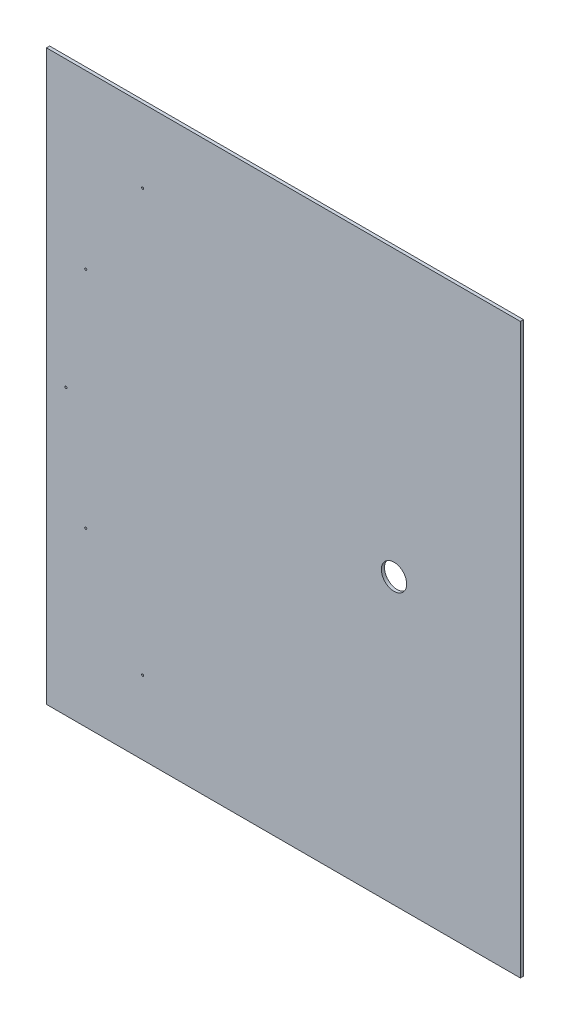
ISO-10303-21;
HEADER;
FILE_DESCRIPTION(('STEP AP214'),'2;1');
FILE_NAME('part.step','',(''),(''),'','','');
FILE_SCHEMA(('AUTOMOTIVE_DESIGN { 1 0 10303 214 1 1 1 1 }'));
ENDSEC;
DATA;
#1=APPLICATION_CONTEXT('core data for automotive mechanical design processes');
#2=APPLICATION_PROTOCOL_DEFINITION('international standard','automotive_design',2000,#1);
#3=PRODUCT_CONTEXT('',#1,'mechanical');
#4=PRODUCT('Part','Part','',(#3));
#5=PRODUCT_RELATED_PRODUCT_CATEGORY('part','',(#4));
#6=PRODUCT_DEFINITION_FORMATION('','',#4);
#7=PRODUCT_DEFINITION_CONTEXT('part definition',#1,'design');
#8=PRODUCT_DEFINITION('design','',#6,#7);
#9=PRODUCT_DEFINITION_SHAPE('','',#8);
#10=(LENGTH_UNIT() NAMED_UNIT(*) SI_UNIT(.MILLI.,.METRE.));
#11=(NAMED_UNIT(*) PLANE_ANGLE_UNIT() SI_UNIT($,.RADIAN.));
#12=(NAMED_UNIT(*) SI_UNIT($,.STERADIAN.) SOLID_ANGLE_UNIT());
#13=UNCERTAINTY_MEASURE_WITH_UNIT(LENGTH_MEASURE(1.E-05),#10,'distance_accuracy_value','');
#14=(GEOMETRIC_REPRESENTATION_CONTEXT(3) GLOBAL_UNCERTAINTY_ASSIGNED_CONTEXT((#13)) GLOBAL_UNIT_ASSIGNED_CONTEXT((#10,
#11,#12)) REPRESENTATION_CONTEXT('',''));
#15=CARTESIAN_POINT('',(0.,0.,0.));
#16=DIRECTION('',(0.,0.,1.));
#17=DIRECTION('',(1.,0.,0.));
#18=AXIS2_PLACEMENT_3D('',#15,#16,#17);
#19=CARTESIAN_POINT('',(-750.,-900.,10.));
#20=DIRECTION('',(-1.,0.,0.));
#21=DIRECTION('',(0.,-1.,0.));
#22=AXIS2_PLACEMENT_3D('',#19,#20,#21);
#23=PLANE('',#22);
#24=DIRECTION('',(0.,1.,0.));
#25=VECTOR('',#24,1.);
#26=CARTESIAN_POINT('',(-750.,-900.,0.));
#27=LINE('',#26,#25);
#28=CARTESIAN_POINT('',(-750.,-900.,0.));
#29=VERTEX_POINT('',#28);
#30=CARTESIAN_POINT('',(-750.,900.,0.));
#31=VERTEX_POINT('',#30);
#32=EDGE_CURVE('E101',#29,#31,#27,.T.);
#33=ORIENTED_EDGE('',*,*,#32,.F.);
#34=DIRECTION('',(0.,0.,-1.));
#35=VECTOR('',#34,1.);
#36=CARTESIAN_POINT('',(-750.,-900.,10.));
#37=LINE('',#36,#35);
#38=CARTESIAN_POINT('',(-750.,-900.,10.));
#39=VERTEX_POINT('',#38);
#40=EDGE_CURVE('E11',#39,#29,#37,.T.);
#41=ORIENTED_EDGE('',*,*,#40,.F.);
#42=DIRECTION('',(0.,1.,0.));
#43=VECTOR('',#42,1.);
#44=CARTESIAN_POINT('',(-750.,-900.,10.));
#45=LINE('',#44,#43);
#46=CARTESIAN_POINT('',(-750.,900.,10.));
#47=VERTEX_POINT('',#46);
#48=EDGE_CURVE('E95',#39,#47,#45,.T.);
#49=ORIENTED_EDGE('',*,*,#48,.T.);
#50=DIRECTION('',(0.,0.,-1.));
#51=VECTOR('',#50,1.);
#52=CARTESIAN_POINT('',(-750.,900.,10.));
#53=LINE('',#52,#51);
#54=EDGE_CURVE('E38',#47,#31,#53,.T.);
#55=ORIENTED_EDGE('',*,*,#54,.T.);
#56=EDGE_LOOP('',(#33,#41,#49,#55));
#57=FACE_BOUND('',#56,.T.);
#58=ADVANCED_FACE('F35',(#57),#23,.T.);
#59=CARTESIAN_POINT('',(-750.,-900.,10.));
#60=DIRECTION('',(0.,1.,0.));
#61=DIRECTION('',(-1.,0.,0.));
#62=AXIS2_PLACEMENT_3D('',#59,#60,#61);
#63=PLANE('',#62);
#64=DIRECTION('',(1.,0.,0.));
#65=VECTOR('',#64,1.);
#66=CARTESIAN_POINT('',(-750.,-900.,0.));
#67=LINE('',#66,#65);
#68=CARTESIAN_POINT('',(750.,-900.,0.));
#69=VERTEX_POINT('',#68);
#70=EDGE_CURVE('E68',#29,#69,#67,.T.);
#71=ORIENTED_EDGE('',*,*,#70,.T.);
#72=DIRECTION('',(0.,0.,-1.));
#73=VECTOR('',#72,1.);
#74=CARTESIAN_POINT('',(750.,-900.,10.));
#75=LINE('',#74,#73);
#76=CARTESIAN_POINT('',(750.,-900.,10.));
#77=VERTEX_POINT('',#76);
#78=EDGE_CURVE('E44',#77,#69,#75,.T.);
#79=ORIENTED_EDGE('',*,*,#78,.F.);
#80=DIRECTION('',(1.,0.,0.));
#81=VECTOR('',#80,1.);
#82=CARTESIAN_POINT('',(-750.,-900.,10.));
#83=LINE('',#82,#81);
#84=EDGE_CURVE('E85',#39,#77,#83,.T.);
#85=ORIENTED_EDGE('',*,*,#84,.F.);
#86=ORIENTED_EDGE('',*,*,#40,.T.);
#87=EDGE_LOOP('',(#71,#79,#85,#86));
#88=FACE_BOUND('',#87,.T.);
#89=ADVANCED_FACE('F112',(#88),#63,.F.);
#90=CARTESIAN_POINT('',(750.,-900.,10.));
#91=DIRECTION('',(-1.,0.,0.));
#92=DIRECTION('',(0.,-1.,0.));
#93=AXIS2_PLACEMENT_3D('',#90,#91,#92);
#94=PLANE('',#93);
#95=DIRECTION('',(0.,1.,0.));
#96=VECTOR('',#95,1.);
#97=CARTESIAN_POINT('',(750.,-900.,0.));
#98=LINE('',#97,#96);
#99=CARTESIAN_POINT('',(750.,900.,0.));
#100=VERTEX_POINT('',#99);
#101=EDGE_CURVE('E92',#69,#100,#98,.T.);
#102=ORIENTED_EDGE('',*,*,#101,.T.);
#103=DIRECTION('',(0.,0.,-1.));
#104=VECTOR('',#103,1.);
#105=CARTESIAN_POINT('',(750.,900.,10.));
#106=LINE('',#105,#104);
#107=CARTESIAN_POINT('',(750.,900.,10.));
#108=VERTEX_POINT('',#107);
#109=EDGE_CURVE('E89',#108,#100,#106,.T.);
#110=ORIENTED_EDGE('',*,*,#109,.F.);
#111=DIRECTION('',(0.,1.,0.));
#112=VECTOR('',#111,1.);
#113=CARTESIAN_POINT('',(750.,-900.,10.));
#114=LINE('',#113,#112);
#115=EDGE_CURVE('E80',#77,#108,#114,.T.);
#116=ORIENTED_EDGE('',*,*,#115,.F.);
#117=ORIENTED_EDGE('',*,*,#78,.T.);
#118=EDGE_LOOP('',(#102,#110,#116,#117));
#119=FACE_BOUND('',#118,.T.);
#120=ADVANCED_FACE('F90',(#119),#94,.F.);
#121=CARTESIAN_POINT('',(-750.,900.,10.));
#122=DIRECTION('',(0.,1.,0.));
#123=DIRECTION('',(-1.,0.,0.));
#124=AXIS2_PLACEMENT_3D('',#121,#122,#123);
#125=PLANE('',#124);
#126=DIRECTION('',(1.,0.,0.));
#127=VECTOR('',#126,1.);
#128=CARTESIAN_POINT('',(-750.,900.,0.));
#129=LINE('',#128,#127);
#130=EDGE_CURVE('E104',#31,#100,#129,.T.);
#131=ORIENTED_EDGE('',*,*,#130,.F.);
#132=ORIENTED_EDGE('',*,*,#54,.F.);
#133=DIRECTION('',(1.,0.,0.));
#134=VECTOR('',#133,1.);
#135=CARTESIAN_POINT('',(-750.,900.,10.));
#136=LINE('',#135,#134);
#137=EDGE_CURVE('E84',#47,#108,#136,.T.);
#138=ORIENTED_EDGE('',*,*,#137,.T.);
#139=ORIENTED_EDGE('',*,*,#109,.T.);
#140=EDGE_LOOP('',(#131,#132,#138,#139));
#141=FACE_BOUND('',#140,.T.);
#142=ADVANCED_FACE('F94',(#141),#125,.T.);
#143=CARTESIAN_POINT('',(0.,0.,10.));
#144=DIRECTION('',(0.,0.,-1.));
#145=DIRECTION('',(-1.,0.,0.));
#146=AXIS2_PLACEMENT_3D('',#143,#144,#145);
#147=PLANE('',#146);
#148=CARTESIAN_POINT('',(-688.392522820021,0.,10.));
#149=DIRECTION('',(0.,0.,-1.));
#150=DIRECTION('',(-1.,0.,0.));
#151=AXIS2_PLACEMENT_3D('',#148,#149,#150);
#152=CIRCLE('',#151,3.29999999999997);
#153=CARTESIAN_POINT('',(-691.692522820021,0.,10.));
#154=VERTEX_POINT('',#153);
#155=EDGE_CURVE('E165',#154,#154,#152,.T.);
#156=ORIENTED_EDGE('',*,*,#155,.T.);
#157=EDGE_LOOP('',(#156));
#158=FACE_BOUND('',#157,.T.);
#159=CARTESIAN_POINT('',(-625.769791173237,355.151159483207,10.));
#160=DIRECTION('',(0.,0.,-1.));
#161=DIRECTION('',(-1.,0.,0.));
#162=AXIS2_PLACEMENT_3D('',#159,#160,#161);
#163=CIRCLE('',#162,3.29999999999997);
#164=CARTESIAN_POINT('',(-629.069791173237,355.151159483207,10.));
#165=VERTEX_POINT('',#164);
#166=EDGE_CURVE('E169',#165,#165,#163,.T.);
#167=ORIENTED_EDGE('',*,*,#166,.T.);
#168=EDGE_LOOP('',(#167));
#169=FACE_BOUND('',#168,.T.);
#170=CARTESIAN_POINT('',(-445.454821882572,667.465847659857,10.));
#171=DIRECTION('',(0.,0.,-1.));
#172=DIRECTION('',(-1.,0.,0.));
#173=AXIS2_PLACEMENT_3D('',#170,#171,#172);
#174=CIRCLE('',#173,3.29999999999997);
#175=CARTESIAN_POINT('',(-448.754821882572,667.465847659857,10.));
#176=VERTEX_POINT('',#175);
#177=EDGE_CURVE('E178',#176,#176,#174,.T.);
#178=ORIENTED_EDGE('',*,*,#177,.T.);
#179=EDGE_LOOP('',(#178));
#180=FACE_BOUND('',#179,.T.);
#181=CARTESIAN_POINT('',(-625.769791173237,-355.151159483207,10.));
#182=DIRECTION('',(0.,0.,-1.));
#183=DIRECTION('',(-1.,0.,0.));
#184=AXIS2_PLACEMENT_3D('',#181,#182,#183);
#185=CIRCLE('',#184,3.29999999999997);
#186=CARTESIAN_POINT('',(-629.069791173237,-355.151159483207,10.));
#187=VERTEX_POINT('',#186);
#188=EDGE_CURVE('E184',#187,#187,#185,.T.);
#189=ORIENTED_EDGE('',*,*,#188,.T.);
#190=EDGE_LOOP('',(#189));
#191=FACE_BOUND('',#190,.T.);
#192=CARTESIAN_POINT('',(-445.454821882574,-667.465847659858,10.));
#193=DIRECTION('',(0.,0.,-1.));
#194=DIRECTION('',(-1.,0.,0.));
#195=AXIS2_PLACEMENT_3D('',#192,#193,#194);
#196=CIRCLE('',#195,3.29999999999997);
#197=CARTESIAN_POINT('',(-448.754821882574,-667.465847659858,10.));
#198=VERTEX_POINT('',#197);
#199=EDGE_CURVE('E190',#198,#198,#196,.T.);
#200=ORIENTED_EDGE('',*,*,#199,.T.);
#201=EDGE_LOOP('',(#200));
#202=FACE_BOUND('',#201,.T.);
#203=CARTESIAN_POINT('',(350.,0.,10.));
#204=DIRECTION('',(0.,0.,1.));
#205=DIRECTION('',(1.,0.,0.));
#206=AXIS2_PLACEMENT_3D('',#203,#204,#205);
#207=CIRCLE('',#206,40.);
#208=CARTESIAN_POINT('',(390.,0.,10.));
#209=VERTEX_POINT('',#208);
#210=EDGE_CURVE('E193',#209,#209,#207,.T.);
#211=ORIENTED_EDGE('',*,*,#210,.F.);
#212=EDGE_LOOP('',(#211));
#213=FACE_BOUND('',#212,.T.);
#214=ORIENTED_EDGE('',*,*,#48,.F.);
#215=ORIENTED_EDGE('',*,*,#84,.T.);
#216=ORIENTED_EDGE('',*,*,#115,.T.);
#217=ORIENTED_EDGE('',*,*,#137,.F.);
#218=EDGE_LOOP('',(#214,#215,#216,#217));
#219=FACE_BOUND('',#218,.T.);
#220=ADVANCED_FACE('F83',(#158,#169,#180,#191,#202,#213,#219),#147,.F.);
#221=CARTESIAN_POINT('',(0.,0.,0.));
#222=DIRECTION('',(0.,0.,-1.));
#223=DIRECTION('',(-1.,0.,0.));
#224=AXIS2_PLACEMENT_3D('',#221,#222,#223);
#225=PLANE('',#224);
#226=CARTESIAN_POINT('',(-688.392522820021,0.,0.));
#227=DIRECTION('',(0.,0.,-1.));
#228=DIRECTION('',(-1.,0.,0.));
#229=AXIS2_PLACEMENT_3D('',#226,#227,#228);
#230=CIRCLE('',#229,3.29999999999997);
#231=CARTESIAN_POINT('',(-691.692522820021,0.,0.));
#232=VERTEX_POINT('',#231);
#233=EDGE_CURVE('E163',#232,#232,#230,.F.);
#234=ORIENTED_EDGE('',*,*,#233,.T.);
#235=EDGE_LOOP('',(#234));
#236=FACE_BOUND('',#235,.T.);
#237=CARTESIAN_POINT('',(-625.769791173237,355.151159483207,0.));
#238=DIRECTION('',(0.,0.,-1.));
#239=DIRECTION('',(-1.,0.,0.));
#240=AXIS2_PLACEMENT_3D('',#237,#238,#239);
#241=CIRCLE('',#240,3.29999999999997);
#242=CARTESIAN_POINT('',(-629.069791173237,355.151159483207,0.));
#243=VERTEX_POINT('',#242);
#244=EDGE_CURVE('E166',#243,#243,#241,.F.);
#245=ORIENTED_EDGE('',*,*,#244,.T.);
#246=EDGE_LOOP('',(#245));
#247=FACE_BOUND('',#246,.T.);
#248=CARTESIAN_POINT('',(-445.454821882572,667.465847659857,0.));
#249=DIRECTION('',(0.,0.,-1.));
#250=DIRECTION('',(-1.,0.,0.));
#251=AXIS2_PLACEMENT_3D('',#248,#249,#250);
#252=CIRCLE('',#251,3.29999999999997);
#253=CARTESIAN_POINT('',(-448.754821882572,667.465847659857,0.));
#254=VERTEX_POINT('',#253);
#255=EDGE_CURVE('E175',#254,#254,#252,.F.);
#256=ORIENTED_EDGE('',*,*,#255,.T.);
#257=EDGE_LOOP('',(#256));
#258=FACE_BOUND('',#257,.T.);
#259=CARTESIAN_POINT('',(-625.769791173237,-355.151159483207,0.));
#260=DIRECTION('',(0.,0.,-1.));
#261=DIRECTION('',(-1.,0.,0.));
#262=AXIS2_PLACEMENT_3D('',#259,#260,#261);
#263=CIRCLE('',#262,3.29999999999997);
#264=CARTESIAN_POINT('',(-629.069791173237,-355.151159483207,0.));
#265=VERTEX_POINT('',#264);
#266=EDGE_CURVE('E181',#265,#265,#263,.F.);
#267=ORIENTED_EDGE('',*,*,#266,.T.);
#268=EDGE_LOOP('',(#267));
#269=FACE_BOUND('',#268,.T.);
#270=CARTESIAN_POINT('',(-445.454821882574,-667.465847659858,0.));
#271=DIRECTION('',(0.,0.,-1.));
#272=DIRECTION('',(-1.,0.,0.));
#273=AXIS2_PLACEMENT_3D('',#270,#271,#272);
#274=CIRCLE('',#273,3.29999999999997);
#275=CARTESIAN_POINT('',(-448.754821882574,-667.465847659858,0.));
#276=VERTEX_POINT('',#275);
#277=EDGE_CURVE('E187',#276,#276,#274,.F.);
#278=ORIENTED_EDGE('',*,*,#277,.T.);
#279=EDGE_LOOP('',(#278));
#280=FACE_BOUND('',#279,.T.);
#281=CARTESIAN_POINT('',(350.,0.,0.));
#282=DIRECTION('',(0.,0.,1.));
#283=DIRECTION('',(1.,0.,0.));
#284=AXIS2_PLACEMENT_3D('',#281,#282,#283);
#285=CIRCLE('',#284,40.);
#286=CARTESIAN_POINT('',(390.,0.,0.));
#287=VERTEX_POINT('',#286);
#288=EDGE_CURVE('E105',#287,#287,#285,.T.);
#289=ORIENTED_EDGE('',*,*,#288,.T.);
#290=EDGE_LOOP('',(#289));
#291=FACE_BOUND('',#290,.T.);
#292=ORIENTED_EDGE('',*,*,#32,.T.);
#293=ORIENTED_EDGE('',*,*,#130,.T.);
#294=ORIENTED_EDGE('',*,*,#101,.F.);
#295=ORIENTED_EDGE('',*,*,#70,.F.);
#296=EDGE_LOOP('',(#292,#293,#294,#295));
#297=FACE_BOUND('',#296,.T.);
#298=ADVANCED_FACE('F110',(#236,#247,#258,#269,#280,#291,#297),#225,.T.);
#299=CARTESIAN_POINT('',(350.,0.,0.));
#300=DIRECTION('',(0.,0.,1.));
#301=DIRECTION('',(1.,0.,0.));
#302=AXIS2_PLACEMENT_3D('',#299,#300,#301);
#303=CYLINDRICAL_SURFACE('',#302,40.);
#304=ORIENTED_EDGE('',*,*,#288,.F.);
#305=EDGE_LOOP('',(#304));
#306=FACE_BOUND('',#305,.T.);
#307=ORIENTED_EDGE('',*,*,#210,.T.);
#308=EDGE_LOOP('',(#307));
#309=FACE_BOUND('',#308,.T.);
#310=ADVANCED_FACE('F131',(#306,#309),#303,.F.);
#311=CARTESIAN_POINT('',(-445.454821882574,-667.465847659858,16.));
#312=DIRECTION('',(0.,0.,1.));
#313=DIRECTION('',(1.,0.,0.));
#314=AXIS2_PLACEMENT_3D('',#311,#312,#313);
#315=CYLINDRICAL_SURFACE('',#314,3.29999999999997);
#316=ORIENTED_EDGE('',*,*,#277,.F.);
#317=EDGE_LOOP('',(#316));
#318=FACE_BOUND('',#317,.T.);
#319=ORIENTED_EDGE('',*,*,#199,.F.);
#320=EDGE_LOOP('',(#319));
#321=FACE_BOUND('',#320,.T.);
#322=ADVANCED_FACE('F138',(#318,#321),#315,.F.);
#323=CARTESIAN_POINT('',(-625.769791173237,-355.151159483207,16.));
#324=DIRECTION('',(0.,0.,1.));
#325=DIRECTION('',(1.,0.,0.));
#326=AXIS2_PLACEMENT_3D('',#323,#324,#325);
#327=CYLINDRICAL_SURFACE('',#326,3.29999999999997);
#328=ORIENTED_EDGE('',*,*,#266,.F.);
#329=EDGE_LOOP('',(#328));
#330=FACE_BOUND('',#329,.T.);
#331=ORIENTED_EDGE('',*,*,#188,.F.);
#332=EDGE_LOOP('',(#331));
#333=FACE_BOUND('',#332,.T.);
#334=ADVANCED_FACE('F142',(#330,#333),#327,.F.);
#335=CARTESIAN_POINT('',(-445.454821882572,667.465847659857,16.));
#336=DIRECTION('',(0.,0.,1.));
#337=DIRECTION('',(1.,0.,0.));
#338=AXIS2_PLACEMENT_3D('',#335,#336,#337);
#339=CYLINDRICAL_SURFACE('',#338,3.29999999999997);
#340=ORIENTED_EDGE('',*,*,#255,.F.);
#341=EDGE_LOOP('',(#340));
#342=FACE_BOUND('',#341,.T.);
#343=ORIENTED_EDGE('',*,*,#177,.F.);
#344=EDGE_LOOP('',(#343));
#345=FACE_BOUND('',#344,.T.);
#346=ADVANCED_FACE('F146',(#342,#345),#339,.F.);
#347=CARTESIAN_POINT('',(-625.769791173237,355.151159483207,16.));
#348=DIRECTION('',(0.,0.,1.));
#349=DIRECTION('',(1.,0.,0.));
#350=AXIS2_PLACEMENT_3D('',#347,#348,#349);
#351=CYLINDRICAL_SURFACE('',#350,3.29999999999997);
#352=ORIENTED_EDGE('',*,*,#244,.F.);
#353=EDGE_LOOP('',(#352));
#354=FACE_BOUND('',#353,.T.);
#355=ORIENTED_EDGE('',*,*,#166,.F.);
#356=EDGE_LOOP('',(#355));
#357=FACE_BOUND('',#356,.T.);
#358=ADVANCED_FACE('F150',(#354,#357),#351,.F.);
#359=CARTESIAN_POINT('',(-688.392522820021,0.,16.));
#360=DIRECTION('',(0.,0.,1.));
#361=DIRECTION('',(1.,0.,0.));
#362=AXIS2_PLACEMENT_3D('',#359,#360,#361);
#363=CYLINDRICAL_SURFACE('',#362,3.29999999999997);
#364=ORIENTED_EDGE('',*,*,#233,.F.);
#365=EDGE_LOOP('',(#364));
#366=FACE_BOUND('',#365,.T.);
#367=ORIENTED_EDGE('',*,*,#155,.F.);
#368=EDGE_LOOP('',(#367));
#369=FACE_BOUND('',#368,.T.);
#370=ADVANCED_FACE('F154',(#366,#369),#363,.F.);
#371=CLOSED_SHELL('',(#58,#89,#120,#142,#220,#298,#310,#322,#334,#346,#358,#370));
#372=MANIFOLD_SOLID_BREP('B2',#371);
#373=ADVANCED_BREP_SHAPE_REPRESENTATION('',(#18,#372),#14);
#374=SHAPE_DEFINITION_REPRESENTATION(#9,#373);
ENDSEC;
END-ISO-10303-21;
